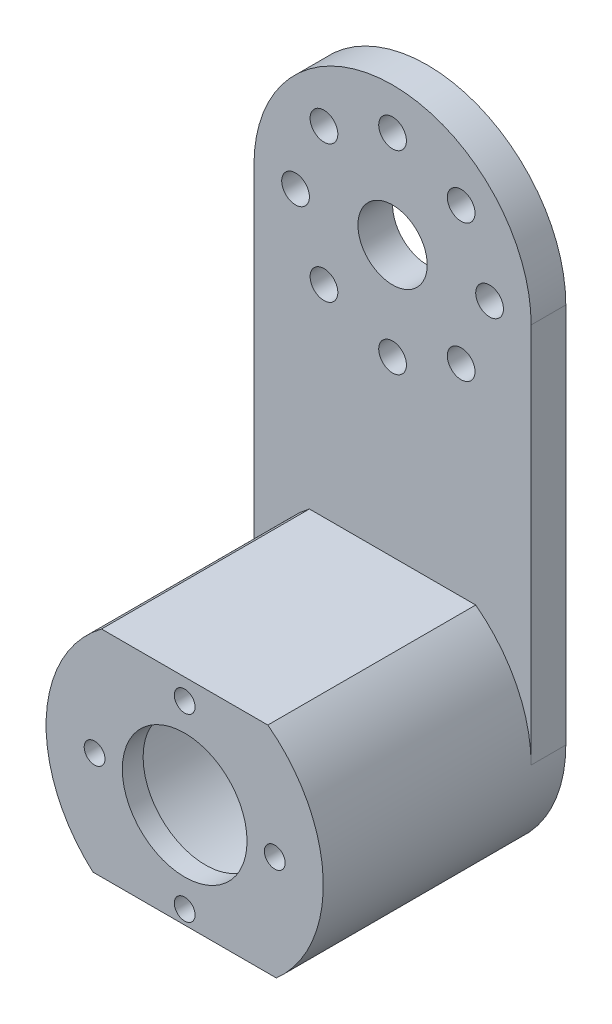
ISO-10303-21;
HEADER;
FILE_DESCRIPTION(('STEP AP214'),'2;1');
FILE_NAME('part.step','',(''),(''),'','','');
FILE_SCHEMA(('AUTOMOTIVE_DESIGN { 1 0 10303 214 1 1 1 1 }'));
ENDSEC;
DATA;
#1=APPLICATION_CONTEXT('core data for automotive mechanical design processes');
#2=APPLICATION_PROTOCOL_DEFINITION('international standard','automotive_design',2000,#1);
#3=PRODUCT_CONTEXT('',#1,'mechanical');
#4=PRODUCT('Part','Part','',(#3));
#5=PRODUCT_RELATED_PRODUCT_CATEGORY('part','',(#4));
#6=PRODUCT_DEFINITION_FORMATION('','',#4);
#7=PRODUCT_DEFINITION_CONTEXT('part definition',#1,'design');
#8=PRODUCT_DEFINITION('design','',#6,#7);
#9=PRODUCT_DEFINITION_SHAPE('','',#8);
#10=(LENGTH_UNIT() NAMED_UNIT(*) SI_UNIT(.MILLI.,.METRE.));
#11=(NAMED_UNIT(*) PLANE_ANGLE_UNIT() SI_UNIT($,.RADIAN.));
#12=(NAMED_UNIT(*) SI_UNIT($,.STERADIAN.) SOLID_ANGLE_UNIT());
#13=UNCERTAINTY_MEASURE_WITH_UNIT(LENGTH_MEASURE(1.E-05),#10,'distance_accuracy_value','');
#14=(GEOMETRIC_REPRESENTATION_CONTEXT(3) GLOBAL_UNCERTAINTY_ASSIGNED_CONTEXT((#13)) GLOBAL_UNIT_ASSIGNED_CONTEXT((#10,
#11,#12)) REPRESENTATION_CONTEXT('',''));
#15=CARTESIAN_POINT('',(0.,0.,0.));
#16=DIRECTION('',(0.,0.,1.));
#17=DIRECTION('',(1.,0.,0.));
#18=AXIS2_PLACEMENT_3D('',#15,#16,#17);
#19=CARTESIAN_POINT('',(0.,-75.,35.));
#20=DIRECTION('',(0.,0.,-1.));
#21=DIRECTION('',(-1.,0.,0.));
#22=AXIS2_PLACEMENT_3D('',#19,#20,#21);
#23=CYLINDRICAL_SURFACE('',#22,8.99999999999999);
#24=CARTESIAN_POINT('',(0.,-75.,35.));
#25=DIRECTION('',(0.,0.,1.));
#26=DIRECTION('',(1.,0.,0.));
#27=AXIS2_PLACEMENT_3D('',#24,#25,#26);
#28=CIRCLE('',#27,8.99999999999999);
#29=CARTESIAN_POINT('',(8.99999999999999,-75.,35.));
#30=VERTEX_POINT('',#29);
#31=EDGE_CURVE('E108',#30,#30,#28,.T.);
#32=ORIENTED_EDGE('',*,*,#31,.T.);
#33=EDGE_LOOP('',(#32));
#34=FACE_BOUND('',#33,.T.);
#35=CARTESIAN_POINT('',(0.,-75.,32.));
#36=DIRECTION('',(0.,0.,-1.));
#37=DIRECTION('',(-1.,0.,0.));
#38=AXIS2_PLACEMENT_3D('',#35,#36,#37);
#39=CIRCLE('',#38,8.99999999999999);
#40=CARTESIAN_POINT('',(-8.99999999999999,-75.,32.));
#41=VERTEX_POINT('',#40);
#42=EDGE_CURVE('E167',#41,#41,#39,.T.);
#43=ORIENTED_EDGE('',*,*,#42,.T.);
#44=EDGE_LOOP('',(#43));
#45=FACE_BOUND('',#44,.T.);
#46=ADVANCED_FACE('F31',(#34,#45),#23,.F.);
#47=CARTESIAN_POINT('',(0.,-62.,35.));
#48=DIRECTION('',(0.,0.,-1.));
#49=DIRECTION('',(-1.,0.,0.));
#50=AXIS2_PLACEMENT_3D('',#47,#48,#49);
#51=CYLINDRICAL_SURFACE('',#50,1.5);
#52=CARTESIAN_POINT('',(0.,-62.,35.));
#53=DIRECTION('',(0.,0.,1.));
#54=DIRECTION('',(1.,0.,0.));
#55=AXIS2_PLACEMENT_3D('',#52,#53,#54);
#56=CIRCLE('',#55,1.5);
#57=CARTESIAN_POINT('',(1.5,-62.,35.));
#58=VERTEX_POINT('',#57);
#59=EDGE_CURVE('E178',#58,#58,#56,.T.);
#60=ORIENTED_EDGE('',*,*,#59,.T.);
#61=EDGE_LOOP('',(#60));
#62=FACE_BOUND('',#61,.T.);
#63=CARTESIAN_POINT('',(0.,-62.,32.));
#64=DIRECTION('',(0.,0.,-1.));
#65=DIRECTION('',(-1.,0.,0.));
#66=AXIS2_PLACEMENT_3D('',#63,#64,#65);
#67=CIRCLE('',#66,1.5);
#68=CARTESIAN_POINT('',(-1.5,-62.,32.));
#69=VERTEX_POINT('',#68);
#70=EDGE_CURVE('E164',#69,#69,#67,.T.);
#71=ORIENTED_EDGE('',*,*,#70,.T.);
#72=EDGE_LOOP('',(#71));
#73=FACE_BOUND('',#72,.T.);
#74=ADVANCED_FACE('F212',(#62,#73),#51,.F.);
#75=CARTESIAN_POINT('',(0.,-88.,35.));
#76=DIRECTION('',(0.,0.,-1.));
#77=DIRECTION('',(-1.,0.,0.));
#78=AXIS2_PLACEMENT_3D('',#75,#76,#77);
#79=CYLINDRICAL_SURFACE('',#78,1.5);
#80=CARTESIAN_POINT('',(0.,-88.,35.));
#81=DIRECTION('',(0.,0.,1.));
#82=DIRECTION('',(1.,0.,0.));
#83=AXIS2_PLACEMENT_3D('',#80,#81,#82);
#84=CIRCLE('',#83,1.5);
#85=CARTESIAN_POINT('',(1.5,-88.,35.));
#86=VERTEX_POINT('',#85);
#87=EDGE_CURVE('E176',#86,#86,#84,.T.);
#88=ORIENTED_EDGE('',*,*,#87,.T.);
#89=EDGE_LOOP('',(#88));
#90=FACE_BOUND('',#89,.T.);
#91=CARTESIAN_POINT('',(0.,-88.,32.));
#92=DIRECTION('',(0.,0.,-1.));
#93=DIRECTION('',(-1.,0.,0.));
#94=AXIS2_PLACEMENT_3D('',#91,#92,#93);
#95=CIRCLE('',#94,1.5);
#96=CARTESIAN_POINT('',(-1.5,-88.,32.));
#97=VERTEX_POINT('',#96);
#98=EDGE_CURVE('E155',#97,#97,#95,.T.);
#99=ORIENTED_EDGE('',*,*,#98,.T.);
#100=EDGE_LOOP('',(#99));
#101=FACE_BOUND('',#100,.T.);
#102=ADVANCED_FACE('F207',(#90,#101),#79,.F.);
#103=CARTESIAN_POINT('',(-13.,-75.,35.));
#104=DIRECTION('',(0.,0.,-1.));
#105=DIRECTION('',(-1.,0.,0.));
#106=AXIS2_PLACEMENT_3D('',#103,#104,#105);
#107=CYLINDRICAL_SURFACE('',#106,1.5);
#108=CARTESIAN_POINT('',(-13.,-75.,35.));
#109=DIRECTION('',(0.,0.,1.));
#110=DIRECTION('',(1.,0.,0.));
#111=AXIS2_PLACEMENT_3D('',#108,#109,#110);
#112=CIRCLE('',#111,1.5);
#113=CARTESIAN_POINT('',(-11.5,-75.,35.));
#114=VERTEX_POINT('',#113);
#115=EDGE_CURVE('E173',#114,#114,#112,.T.);
#116=ORIENTED_EDGE('',*,*,#115,.T.);
#117=EDGE_LOOP('',(#116));
#118=FACE_BOUND('',#117,.T.);
#119=CARTESIAN_POINT('',(-13.,-75.,32.));
#120=DIRECTION('',(0.,0.,-1.));
#121=DIRECTION('',(-1.,0.,0.));
#122=AXIS2_PLACEMENT_3D('',#119,#120,#121);
#123=CIRCLE('',#122,1.5);
#124=CARTESIAN_POINT('',(-14.5,-75.,32.));
#125=VERTEX_POINT('',#124);
#126=EDGE_CURVE('E151',#125,#125,#123,.T.);
#127=ORIENTED_EDGE('',*,*,#126,.T.);
#128=EDGE_LOOP('',(#127));
#129=FACE_BOUND('',#128,.T.);
#130=ADVANCED_FACE('F199',(#118,#129),#107,.F.);
#131=CARTESIAN_POINT('',(13.,-75.,35.));
#132=DIRECTION('',(0.,0.,-1.));
#133=DIRECTION('',(-1.,0.,0.));
#134=AXIS2_PLACEMENT_3D('',#131,#132,#133);
#135=CYLINDRICAL_SURFACE('',#134,1.5);
#136=CARTESIAN_POINT('',(13.,-75.,35.));
#137=DIRECTION('',(0.,0.,1.));
#138=DIRECTION('',(1.,0.,0.));
#139=AXIS2_PLACEMENT_3D('',#136,#137,#138);
#140=CIRCLE('',#139,1.5);
#141=CARTESIAN_POINT('',(14.5,-75.,35.));
#142=VERTEX_POINT('',#141);
#143=EDGE_CURVE('E170',#142,#142,#140,.T.);
#144=ORIENTED_EDGE('',*,*,#143,.T.);
#145=EDGE_LOOP('',(#144));
#146=FACE_BOUND('',#145,.T.);
#147=CARTESIAN_POINT('',(13.,-75.,32.));
#148=DIRECTION('',(0.,0.,-1.));
#149=DIRECTION('',(-1.,0.,0.));
#150=AXIS2_PLACEMENT_3D('',#147,#148,#149);
#151=CIRCLE('',#150,1.5);
#152=CARTESIAN_POINT('',(11.5,-75.,32.));
#153=VERTEX_POINT('',#152);
#154=EDGE_CURVE('E149',#153,#153,#151,.T.);
#155=ORIENTED_EDGE('',*,*,#154,.T.);
#156=EDGE_LOOP('',(#155));
#157=FACE_BOUND('',#156,.T.);
#158=ADVANCED_FACE('F196',(#146,#157),#135,.F.);
#159=CARTESIAN_POINT('',(0.,-20.,5.));
#160=DIRECTION('',(0.,0.,1.));
#161=DIRECTION('',(1.,0.,0.));
#162=AXIS2_PLACEMENT_3D('',#159,#160,#161);
#163=PLANE('',#162);
#164=CARTESIAN_POINT('',(0.,-75.,5.));
#165=DIRECTION('',(0.,0.,1.));
#166=DIRECTION('',(1.,0.,0.));
#167=AXIS2_PLACEMENT_3D('',#164,#165,#166);
#168=CIRCLE('',#167,20.);
#169=CARTESIAN_POINT('',(-12.,-59.,5.));
#170=VERTEX_POINT('',#169);
#171=CARTESIAN_POINT('',(-20.,-75.,5.));
#172=VERTEX_POINT('',#171);
#173=EDGE_CURVE('E112',#170,#172,#168,.T.);
#174=ORIENTED_EDGE('',*,*,#173,.F.);
#175=DIRECTION('',(-1.,0.,0.));
#176=VECTOR('',#175,1.);
#177=CARTESIAN_POINT('',(12.,-59.,5.));
#178=LINE('',#177,#176);
#179=CARTESIAN_POINT('',(12.,-59.,5.));
#180=VERTEX_POINT('',#179);
#181=EDGE_CURVE('E52',#180,#170,#178,.T.);
#182=ORIENTED_EDGE('',*,*,#181,.F.);
#183=CARTESIAN_POINT('',(20.,-75.,5.));
#184=VERTEX_POINT('',#183);
#185=EDGE_CURVE('E39',#184,#180,#168,.T.);
#186=ORIENTED_EDGE('',*,*,#185,.F.);
#187=DIRECTION('',(0.,1.,0.));
#188=VECTOR('',#187,1.);
#189=CARTESIAN_POINT('',(20.,-20.,5.));
#190=LINE('',#189,#188);
#191=CARTESIAN_POINT('',(20.,-20.,5.));
#192=VERTEX_POINT('',#191);
#193=EDGE_CURVE('E137',#184,#192,#190,.T.);
#194=ORIENTED_EDGE('',*,*,#193,.T.);
#195=CARTESIAN_POINT('',(0.,-20.,5.));
#196=DIRECTION('',(0.,0.,1.));
#197=DIRECTION('',(1.,0.,0.));
#198=AXIS2_PLACEMENT_3D('',#195,#196,#197);
#199=CIRCLE('',#198,20.);
#200=CARTESIAN_POINT('',(-20.,-20.,5.));
#201=VERTEX_POINT('',#200);
#202=EDGE_CURVE('E143',#192,#201,#199,.T.);
#203=ORIENTED_EDGE('',*,*,#202,.T.);
#204=DIRECTION('',(0.,-1.,0.));
#205=VECTOR('',#204,1.);
#206=CARTESIAN_POINT('',(-20.,-20.,5.));
#207=LINE('',#206,#205);
#208=EDGE_CURVE('E139',#201,#172,#207,.T.);
#209=ORIENTED_EDGE('',*,*,#208,.T.);
#210=EDGE_LOOP('',(#174,#182,#186,#194,#203,#209));
#211=FACE_BOUND('',#210,.T.);
#212=CARTESIAN_POINT('',(-1.42247325030098E-13,-34.,5.));
#213=DIRECTION('',(0.,0.,1.));
#214=DIRECTION('',(1.,0.,0.));
#215=AXIS2_PLACEMENT_3D('',#212,#213,#214);
#216=CIRCLE('',#215,2.);
#217=CARTESIAN_POINT('',(1.99999999999985,-34.,5.));
#218=VERTEX_POINT('',#217);
#219=EDGE_CURVE('E346',#218,#218,#216,.T.);
#220=ORIENTED_EDGE('',*,*,#219,.F.);
#221=EDGE_LOOP('',(#220));
#222=FACE_BOUND('',#221,.T.);
#223=CARTESIAN_POINT('',(14.,-20.0000000000001,5.));
#224=DIRECTION('',(0.,0.,1.));
#225=DIRECTION('',(1.,0.,0.));
#226=AXIS2_PLACEMENT_3D('',#223,#224,#225);
#227=CIRCLE('',#226,2.);
#228=CARTESIAN_POINT('',(16.,-20.0000000000001,5.));
#229=VERTEX_POINT('',#228);
#230=EDGE_CURVE('E334',#229,#229,#227,.T.);
#231=ORIENTED_EDGE('',*,*,#230,.F.);
#232=EDGE_LOOP('',(#231));
#233=FACE_BOUND('',#232,.T.);
#234=CARTESIAN_POINT('',(0.,-6.,5.));
#235=DIRECTION('',(0.,0.,1.));
#236=DIRECTION('',(1.,0.,0.));
#237=AXIS2_PLACEMENT_3D('',#234,#235,#236);
#238=CIRCLE('',#237,2.);
#239=CARTESIAN_POINT('',(2.00000000000005,-6.,5.));
#240=VERTEX_POINT('',#239);
#241=EDGE_CURVE('E322',#240,#240,#238,.T.);
#242=ORIENTED_EDGE('',*,*,#241,.F.);
#243=EDGE_LOOP('',(#242));
#244=FACE_BOUND('',#243,.T.);
#245=CARTESIAN_POINT('',(-14.,-20.,5.));
#246=DIRECTION('',(0.,0.,1.));
#247=DIRECTION('',(1.,0.,0.));
#248=AXIS2_PLACEMENT_3D('',#245,#246,#247);
#249=CIRCLE('',#248,2.);
#250=CARTESIAN_POINT('',(-12.,-20.,5.));
#251=VERTEX_POINT('',#250);
#252=EDGE_CURVE('E310',#251,#251,#249,.T.);
#253=ORIENTED_EDGE('',*,*,#252,.F.);
#254=EDGE_LOOP('',(#253));
#255=FACE_BOUND('',#254,.T.);
#256=CARTESIAN_POINT('',(0.,-20.,5.));
#257=DIRECTION('',(0.,0.,1.));
#258=DIRECTION('',(1.,0.,0.));
#259=AXIS2_PLACEMENT_3D('',#256,#257,#258);
#260=CIRCLE('',#259,5.);
#261=CARTESIAN_POINT('',(5.,-20.,5.));
#262=VERTEX_POINT('',#261);
#263=EDGE_CURVE('E303',#262,#262,#260,.T.);
#264=ORIENTED_EDGE('',*,*,#263,.F.);
#265=EDGE_LOOP('',(#264));
#266=FACE_BOUND('',#265,.T.);
#267=CARTESIAN_POINT('',(-9.89949493661165,-10.1005050633883,5.));
#268=DIRECTION('',(0.,0.,1.));
#269=DIRECTION('',(1.,0.,0.));
#270=AXIS2_PLACEMENT_3D('',#267,#268,#269);
#271=CIRCLE('',#270,2.);
#272=CARTESIAN_POINT('',(-7.89949493661165,-10.1005050633883,5.));
#273=VERTEX_POINT('',#272);
#274=EDGE_CURVE('E316',#273,#273,#271,.T.);
#275=ORIENTED_EDGE('',*,*,#274,.F.);
#276=EDGE_LOOP('',(#275));
#277=FACE_BOUND('',#276,.T.);
#278=CARTESIAN_POINT('',(9.89949493661171,-10.1005050633884,5.));
#279=DIRECTION('',(0.,0.,1.));
#280=DIRECTION('',(1.,0.,0.));
#281=AXIS2_PLACEMENT_3D('',#278,#279,#280);
#282=CIRCLE('',#281,2.);
#283=CARTESIAN_POINT('',(11.8994949366117,-10.1005050633884,5.));
#284=VERTEX_POINT('',#283);
#285=EDGE_CURVE('E328',#284,#284,#282,.T.);
#286=ORIENTED_EDGE('',*,*,#285,.F.);
#287=EDGE_LOOP('',(#286));
#288=FACE_BOUND('',#287,.T.);
#289=CARTESIAN_POINT('',(9.89949493661159,-29.8994949366118,5.));
#290=DIRECTION('',(0.,0.,1.));
#291=DIRECTION('',(1.,0.,0.));
#292=AXIS2_PLACEMENT_3D('',#289,#290,#291);
#293=CIRCLE('',#292,2.);
#294=CARTESIAN_POINT('',(11.8994949366116,-29.8994949366118,5.));
#295=VERTEX_POINT('',#294);
#296=EDGE_CURVE('E340',#295,#295,#293,.T.);
#297=ORIENTED_EDGE('',*,*,#296,.F.);
#298=EDGE_LOOP('',(#297));
#299=FACE_BOUND('',#298,.T.);
#300=CARTESIAN_POINT('',(-9.89949493661179,-29.8994949366115,5.));
#301=DIRECTION('',(0.,0.,1.));
#302=DIRECTION('',(1.,0.,0.));
#303=AXIS2_PLACEMENT_3D('',#300,#301,#302);
#304=CIRCLE('',#303,2.);
#305=CARTESIAN_POINT('',(-7.89949493661178,-29.8994949366115,5.));
#306=VERTEX_POINT('',#305);
#307=EDGE_CURVE('E121',#306,#306,#304,.T.);
#308=ORIENTED_EDGE('',*,*,#307,.F.);
#309=EDGE_LOOP('',(#308));
#310=FACE_BOUND('',#309,.T.);
#311=ADVANCED_FACE('F198',(#211,#222,#233,#244,#255,#266,#277,#288,#299,#310),#163,.T.);
#312=CARTESIAN_POINT('',(0.,-20.,0.));
#313=DIRECTION('',(0.,0.,1.));
#314=DIRECTION('',(1.,0.,0.));
#315=AXIS2_PLACEMENT_3D('',#312,#313,#314);
#316=PLANE('',#315);
#317=CARTESIAN_POINT('',(-1.42247325030098E-13,-34.,0.));
#318=DIRECTION('',(0.,0.,1.));
#319=DIRECTION('',(1.,0.,0.));
#320=AXIS2_PLACEMENT_3D('',#317,#318,#319);
#321=CIRCLE('',#320,2.);
#322=CARTESIAN_POINT('',(1.99999999999985,-34.,0.));
#323=VERTEX_POINT('',#322);
#324=EDGE_CURVE('E349',#323,#323,#321,.T.);
#325=ORIENTED_EDGE('',*,*,#324,.T.);
#326=EDGE_LOOP('',(#325));
#327=FACE_BOUND('',#326,.T.);
#328=CARTESIAN_POINT('',(14.,-20.0000000000001,0.));
#329=DIRECTION('',(0.,0.,1.));
#330=DIRECTION('',(1.,0.,0.));
#331=AXIS2_PLACEMENT_3D('',#328,#329,#330);
#332=CIRCLE('',#331,2.);
#333=CARTESIAN_POINT('',(16.,-20.0000000000001,0.));
#334=VERTEX_POINT('',#333);
#335=EDGE_CURVE('E337',#334,#334,#332,.T.);
#336=ORIENTED_EDGE('',*,*,#335,.T.);
#337=EDGE_LOOP('',(#336));
#338=FACE_BOUND('',#337,.T.);
#339=CARTESIAN_POINT('',(0.,-6.,0.));
#340=DIRECTION('',(0.,0.,1.));
#341=DIRECTION('',(1.,0.,0.));
#342=AXIS2_PLACEMENT_3D('',#339,#340,#341);
#343=CIRCLE('',#342,2.);
#344=CARTESIAN_POINT('',(2.00000000000005,-6.,0.));
#345=VERTEX_POINT('',#344);
#346=EDGE_CURVE('E325',#345,#345,#343,.T.);
#347=ORIENTED_EDGE('',*,*,#346,.T.);
#348=EDGE_LOOP('',(#347));
#349=FACE_BOUND('',#348,.T.);
#350=CARTESIAN_POINT('',(-14.,-20.,0.));
#351=DIRECTION('',(0.,0.,1.));
#352=DIRECTION('',(1.,0.,0.));
#353=AXIS2_PLACEMENT_3D('',#350,#351,#352);
#354=CIRCLE('',#353,2.);
#355=CARTESIAN_POINT('',(-12.,-20.,0.));
#356=VERTEX_POINT('',#355);
#357=EDGE_CURVE('E313',#356,#356,#354,.T.);
#358=ORIENTED_EDGE('',*,*,#357,.T.);
#359=EDGE_LOOP('',(#358));
#360=FACE_BOUND('',#359,.T.);
#361=CARTESIAN_POINT('',(0.,-75.,0.));
#362=DIRECTION('',(0.,0.,1.));
#363=DIRECTION('',(1.,0.,0.));
#364=AXIS2_PLACEMENT_3D('',#361,#362,#363);
#365=CIRCLE('',#364,15.);
#366=CARTESIAN_POINT('',(15.,-75.,0.));
#367=VERTEX_POINT('',#366);
#368=EDGE_CURVE('E301',#367,#367,#365,.T.);
#369=ORIENTED_EDGE('',*,*,#368,.T.);
#370=EDGE_LOOP('',(#369));
#371=FACE_BOUND('',#370,.T.);
#372=CARTESIAN_POINT('',(0.,-20.,0.));
#373=DIRECTION('',(0.,0.,1.));
#374=DIRECTION('',(1.,0.,0.));
#375=AXIS2_PLACEMENT_3D('',#372,#373,#374);
#376=CIRCLE('',#375,20.);
#377=CARTESIAN_POINT('',(20.,-20.,0.));
#378=VERTEX_POINT('',#377);
#379=CARTESIAN_POINT('',(-20.,-20.,0.));
#380=VERTEX_POINT('',#379);
#381=EDGE_CURVE('E287',#378,#380,#376,.T.);
#382=ORIENTED_EDGE('',*,*,#381,.F.);
#383=DIRECTION('',(0.,1.,0.));
#384=VECTOR('',#383,1.);
#385=CARTESIAN_POINT('',(20.,-20.,0.));
#386=LINE('',#385,#384);
#387=CARTESIAN_POINT('',(20.,-75.,0.));
#388=VERTEX_POINT('',#387);
#389=EDGE_CURVE('E292',#388,#378,#386,.T.);
#390=ORIENTED_EDGE('',*,*,#389,.F.);
#391=CARTESIAN_POINT('',(0.,-75.,0.));
#392=DIRECTION('',(0.,0.,1.));
#393=DIRECTION('',(1.,0.,0.));
#394=AXIS2_PLACEMENT_3D('',#391,#392,#393);
#395=CIRCLE('',#394,20.);
#396=CARTESIAN_POINT('',(-20.,-75.,0.));
#397=VERTEX_POINT('',#396);
#398=EDGE_CURVE('E286',#397,#388,#395,.T.);
#399=ORIENTED_EDGE('',*,*,#398,.F.);
#400=DIRECTION('',(0.,-1.,0.));
#401=VECTOR('',#400,1.);
#402=CARTESIAN_POINT('',(-20.,-20.,0.));
#403=LINE('',#402,#401);
#404=EDGE_CURVE('E280',#380,#397,#403,.T.);
#405=ORIENTED_EDGE('',*,*,#404,.F.);
#406=EDGE_LOOP('',(#382,#390,#399,#405));
#407=FACE_BOUND('',#406,.T.);
#408=CARTESIAN_POINT('',(0.,-20.,0.));
#409=DIRECTION('',(0.,0.,1.));
#410=DIRECTION('',(1.,0.,0.));
#411=AXIS2_PLACEMENT_3D('',#408,#409,#410);
#412=CIRCLE('',#411,5.);
#413=CARTESIAN_POINT('',(5.,-20.,0.));
#414=VERTEX_POINT('',#413);
#415=EDGE_CURVE('E307',#414,#414,#412,.T.);
#416=ORIENTED_EDGE('',*,*,#415,.T.);
#417=EDGE_LOOP('',(#416));
#418=FACE_BOUND('',#417,.T.);
#419=CARTESIAN_POINT('',(-9.89949493661165,-10.1005050633883,0.));
#420=DIRECTION('',(0.,0.,1.));
#421=DIRECTION('',(1.,0.,0.));
#422=AXIS2_PLACEMENT_3D('',#419,#420,#421);
#423=CIRCLE('',#422,2.);
#424=CARTESIAN_POINT('',(-7.89949493661165,-10.1005050633883,0.));
#425=VERTEX_POINT('',#424);
#426=EDGE_CURVE('E319',#425,#425,#423,.T.);
#427=ORIENTED_EDGE('',*,*,#426,.T.);
#428=EDGE_LOOP('',(#427));
#429=FACE_BOUND('',#428,.T.);
#430=CARTESIAN_POINT('',(9.89949493661171,-10.1005050633884,0.));
#431=DIRECTION('',(0.,0.,1.));
#432=DIRECTION('',(1.,0.,0.));
#433=AXIS2_PLACEMENT_3D('',#430,#431,#432);
#434=CIRCLE('',#433,2.);
#435=CARTESIAN_POINT('',(11.8994949366117,-10.1005050633884,0.));
#436=VERTEX_POINT('',#435);
#437=EDGE_CURVE('E331',#436,#436,#434,.T.);
#438=ORIENTED_EDGE('',*,*,#437,.T.);
#439=EDGE_LOOP('',(#438));
#440=FACE_BOUND('',#439,.T.);
#441=CARTESIAN_POINT('',(9.89949493661159,-29.8994949366118,0.));
#442=DIRECTION('',(0.,0.,1.));
#443=DIRECTION('',(1.,0.,0.));
#444=AXIS2_PLACEMENT_3D('',#441,#442,#443);
#445=CIRCLE('',#444,2.);
#446=CARTESIAN_POINT('',(11.8994949366116,-29.8994949366118,0.));
#447=VERTEX_POINT('',#446);
#448=EDGE_CURVE('E343',#447,#447,#445,.T.);
#449=ORIENTED_EDGE('',*,*,#448,.T.);
#450=EDGE_LOOP('',(#449));
#451=FACE_BOUND('',#450,.T.);
#452=CARTESIAN_POINT('',(-9.89949493661179,-29.8994949366115,0.));
#453=DIRECTION('',(0.,0.,1.));
#454=DIRECTION('',(1.,0.,0.));
#455=AXIS2_PLACEMENT_3D('',#452,#453,#454);
#456=CIRCLE('',#455,2.);
#457=CARTESIAN_POINT('',(-7.89949493661178,-29.8994949366115,0.));
#458=VERTEX_POINT('',#457);
#459=EDGE_CURVE('E117',#458,#458,#456,.T.);
#460=ORIENTED_EDGE('',*,*,#459,.T.);
#461=EDGE_LOOP('',(#460));
#462=FACE_BOUND('',#461,.T.);
#463=ADVANCED_FACE('F205',(#327,#338,#349,#360,#371,#407,#418,#429,#440,#451,#462),#316,.F.);
#464=CARTESIAN_POINT('',(0.,-20.,5.));
#465=DIRECTION('',(0.,0.,-1.));
#466=DIRECTION('',(-1.,0.,0.));
#467=AXIS2_PLACEMENT_3D('',#464,#465,#466);
#468=CYLINDRICAL_SURFACE('',#467,20.);
#469=ORIENTED_EDGE('',*,*,#381,.T.);
#470=DIRECTION('',(0.,0.,-1.));
#471=VECTOR('',#470,1.);
#472=CARTESIAN_POINT('',(-20.,-20.,5.));
#473=LINE('',#472,#471);
#474=EDGE_CURVE('E126',#201,#380,#473,.T.);
#475=ORIENTED_EDGE('',*,*,#474,.F.);
#476=ORIENTED_EDGE('',*,*,#202,.F.);
#477=DIRECTION('',(0.,0.,-1.));
#478=VECTOR('',#477,1.);
#479=CARTESIAN_POINT('',(20.,-20.,5.));
#480=LINE('',#479,#478);
#481=EDGE_CURVE('E134',#192,#378,#480,.T.);
#482=ORIENTED_EDGE('',*,*,#481,.T.);
#483=EDGE_LOOP('',(#469,#475,#476,#482));
#484=FACE_BOUND('',#483,.T.);
#485=ADVANCED_FACE('F33',(#484),#468,.T.);
#486=CARTESIAN_POINT('',(-20.,-20.,5.));
#487=DIRECTION('',(1.,0.,0.));
#488=DIRECTION('',(0.,1.,0.));
#489=AXIS2_PLACEMENT_3D('',#486,#487,#488);
#490=PLANE('',#489);
#491=ORIENTED_EDGE('',*,*,#404,.T.);
#492=DIRECTION('',(0.,0.,-1.));
#493=VECTOR('',#492,1.);
#494=CARTESIAN_POINT('',(-20.,-75.,5.));
#495=LINE('',#494,#493);
#496=EDGE_CURVE('E133',#172,#397,#495,.T.);
#497=ORIENTED_EDGE('',*,*,#496,.F.);
#498=ORIENTED_EDGE('',*,*,#208,.F.);
#499=ORIENTED_EDGE('',*,*,#474,.T.);
#500=EDGE_LOOP('',(#491,#497,#498,#499));
#501=FACE_BOUND('',#500,.T.);
#502=ADVANCED_FACE('F271',(#501),#490,.F.);
#503=CARTESIAN_POINT('',(0.,-75.,5.));
#504=DIRECTION('',(0.,0.,-1.));
#505=DIRECTION('',(-1.,0.,0.));
#506=AXIS2_PLACEMENT_3D('',#503,#504,#505);
#507=CYLINDRICAL_SURFACE('',#506,20.);
#508=CARTESIAN_POINT('',(0.,-75.,50.));
#509=DIRECTION('',(0.,0.707106781186547,-0.707106781186548));
#510=DIRECTION('',(0.,-0.707106781186548,-0.707106781186547));
#511=AXIS2_PLACEMENT_3D('',#508,#509,#510);
#512=ELLIPSE('',#511,28.2842712474619,20.);
#513=CARTESIAN_POINT('',(13.228756555323,-90.,35.));
#514=VERTEX_POINT('',#513);
#515=CARTESIAN_POINT('',(-13.228756555323,-90.,35.));
#516=VERTEX_POINT('',#515);
#517=EDGE_CURVE('E44',#514,#516,#512,.T.);
#518=ORIENTED_EDGE('',*,*,#517,.T.);
#519=CARTESIAN_POINT('',(0.,-75.,35.));
#520=DIRECTION('',(0.,0.,1.));
#521=DIRECTION('',(1.,0.,0.));
#522=AXIS2_PLACEMENT_3D('',#519,#520,#521);
#523=CIRCLE('',#522,20.);
#524=CARTESIAN_POINT('',(-12.,-59.,35.));
#525=VERTEX_POINT('',#524);
#526=EDGE_CURVE('E92',#525,#516,#523,.T.);
#527=ORIENTED_EDGE('',*,*,#526,.F.);
#528=DIRECTION('',(0.,0.,-1.));
#529=VECTOR('',#528,1.);
#530=CARTESIAN_POINT('',(-12.,-59.,35.));
#531=LINE('',#530,#529);
#532=EDGE_CURVE('E105',#525,#170,#531,.T.);
#533=ORIENTED_EDGE('',*,*,#532,.T.);
#534=ORIENTED_EDGE('',*,*,#173,.T.);
#535=ORIENTED_EDGE('',*,*,#496,.T.);
#536=ORIENTED_EDGE('',*,*,#398,.T.);
#537=DIRECTION('',(0.,0.,-1.));
#538=VECTOR('',#537,1.);
#539=CARTESIAN_POINT('',(20.,-75.,5.));
#540=LINE('',#539,#538);
#541=EDGE_CURVE('E130',#184,#388,#540,.T.);
#542=ORIENTED_EDGE('',*,*,#541,.F.);
#543=ORIENTED_EDGE('',*,*,#185,.T.);
#544=DIRECTION('',(0.,0.,-1.));
#545=VECTOR('',#544,1.);
#546=CARTESIAN_POINT('',(12.,-59.,35.));
#547=LINE('',#546,#545);
#548=CARTESIAN_POINT('',(12.,-59.,35.));
#549=VERTEX_POINT('',#548);
#550=EDGE_CURVE('E114',#549,#180,#547,.T.);
#551=ORIENTED_EDGE('',*,*,#550,.F.);
#552=EDGE_CURVE('E94',#514,#549,#523,.T.);
#553=ORIENTED_EDGE('',*,*,#552,.F.);
#554=EDGE_LOOP('',(#518,#527,#533,#534,#535,#536,#542,#543,#551,#553));
#555=FACE_BOUND('',#554,.T.);
#556=ADVANCED_FACE('F89',(#555),#507,.T.);
#557=CARTESIAN_POINT('',(20.,-20.,5.));
#558=DIRECTION('',(-1.,0.,0.));
#559=DIRECTION('',(0.,-1.,0.));
#560=AXIS2_PLACEMENT_3D('',#557,#558,#559);
#561=PLANE('',#560);
#562=ORIENTED_EDGE('',*,*,#389,.T.);
#563=ORIENTED_EDGE('',*,*,#481,.F.);
#564=ORIENTED_EDGE('',*,*,#193,.F.);
#565=ORIENTED_EDGE('',*,*,#541,.T.);
#566=EDGE_LOOP('',(#562,#563,#564,#565));
#567=FACE_BOUND('',#566,.T.);
#568=ADVANCED_FACE('F261',(#567),#561,.F.);
#569=CARTESIAN_POINT('',(0.,-75.,5.));
#570=DIRECTION('',(0.,0.,-1.));
#571=DIRECTION('',(-1.,0.,0.));
#572=AXIS2_PLACEMENT_3D('',#569,#570,#571);
#573=CYLINDRICAL_SURFACE('',#572,15.);
#574=ORIENTED_EDGE('',*,*,#368,.F.);
#575=EDGE_LOOP('',(#574));
#576=FACE_BOUND('',#575,.T.);
#577=CARTESIAN_POINT('',(0.,-75.,32.));
#578=DIRECTION('',(0.,0.,-1.));
#579=DIRECTION('',(-1.,0.,0.));
#580=AXIS2_PLACEMENT_3D('',#577,#578,#579);
#581=CIRCLE('',#580,15.);
#582=CARTESIAN_POINT('',(-15.,-75.,32.));
#583=VERTEX_POINT('',#582);
#584=EDGE_CURVE('E95',#583,#583,#581,.T.);
#585=ORIENTED_EDGE('',*,*,#584,.F.);
#586=EDGE_LOOP('',(#585));
#587=FACE_BOUND('',#586,.T.);
#588=ADVANCED_FACE('F258',(#576,#587),#573,.F.);
#589=CARTESIAN_POINT('',(0.,-20.,5.));
#590=DIRECTION('',(0.,0.,-1.));
#591=DIRECTION('',(-1.,0.,0.));
#592=AXIS2_PLACEMENT_3D('',#589,#590,#591);
#593=CYLINDRICAL_SURFACE('',#592,5.);
#594=ORIENTED_EDGE('',*,*,#263,.T.);
#595=EDGE_LOOP('',(#594));
#596=FACE_BOUND('',#595,.T.);
#597=ORIENTED_EDGE('',*,*,#415,.F.);
#598=EDGE_LOOP('',(#597));
#599=FACE_BOUND('',#598,.T.);
#600=ADVANCED_FACE('F254',(#596,#599),#593,.F.);
#601=CARTESIAN_POINT('',(-14.,-20.,5.));
#602=DIRECTION('',(0.,0.,-1.));
#603=DIRECTION('',(-1.,0.,0.));
#604=AXIS2_PLACEMENT_3D('',#601,#602,#603);
#605=CYLINDRICAL_SURFACE('',#604,2.);
#606=ORIENTED_EDGE('',*,*,#252,.T.);
#607=EDGE_LOOP('',(#606));
#608=FACE_BOUND('',#607,.T.);
#609=ORIENTED_EDGE('',*,*,#357,.F.);
#610=EDGE_LOOP('',(#609));
#611=FACE_BOUND('',#610,.T.);
#612=ADVANCED_FACE('F250',(#608,#611),#605,.F.);
#613=CARTESIAN_POINT('',(-9.89949493661165,-10.1005050633883,5.));
#614=DIRECTION('',(0.,0.,-1.));
#615=DIRECTION('',(-1.,0.,0.));
#616=AXIS2_PLACEMENT_3D('',#613,#614,#615);
#617=CYLINDRICAL_SURFACE('',#616,2.);
#618=ORIENTED_EDGE('',*,*,#274,.T.);
#619=EDGE_LOOP('',(#618));
#620=FACE_BOUND('',#619,.T.);
#621=ORIENTED_EDGE('',*,*,#426,.F.);
#622=EDGE_LOOP('',(#621));
#623=FACE_BOUND('',#622,.T.);
#624=ADVANCED_FACE('F246',(#620,#623),#617,.F.);
#625=CARTESIAN_POINT('',(0.,-6.,5.));
#626=DIRECTION('',(0.,0.,-1.));
#627=DIRECTION('',(-1.,0.,0.));
#628=AXIS2_PLACEMENT_3D('',#625,#626,#627);
#629=CYLINDRICAL_SURFACE('',#628,2.);
#630=ORIENTED_EDGE('',*,*,#241,.T.);
#631=EDGE_LOOP('',(#630));
#632=FACE_BOUND('',#631,.T.);
#633=ORIENTED_EDGE('',*,*,#346,.F.);
#634=EDGE_LOOP('',(#633));
#635=FACE_BOUND('',#634,.T.);
#636=ADVANCED_FACE('F242',(#632,#635),#629,.F.);
#637=CARTESIAN_POINT('',(9.89949493661171,-10.1005050633884,5.));
#638=DIRECTION('',(0.,0.,-1.));
#639=DIRECTION('',(-1.,0.,0.));
#640=AXIS2_PLACEMENT_3D('',#637,#638,#639);
#641=CYLINDRICAL_SURFACE('',#640,2.);
#642=ORIENTED_EDGE('',*,*,#285,.T.);
#643=EDGE_LOOP('',(#642));
#644=FACE_BOUND('',#643,.T.);
#645=ORIENTED_EDGE('',*,*,#437,.F.);
#646=EDGE_LOOP('',(#645));
#647=FACE_BOUND('',#646,.T.);
#648=ADVANCED_FACE('F238',(#644,#647),#641,.F.);
#649=CARTESIAN_POINT('',(14.,-20.0000000000001,5.));
#650=DIRECTION('',(0.,0.,-1.));
#651=DIRECTION('',(-1.,0.,0.));
#652=AXIS2_PLACEMENT_3D('',#649,#650,#651);
#653=CYLINDRICAL_SURFACE('',#652,2.);
#654=ORIENTED_EDGE('',*,*,#230,.T.);
#655=EDGE_LOOP('',(#654));
#656=FACE_BOUND('',#655,.T.);
#657=ORIENTED_EDGE('',*,*,#335,.F.);
#658=EDGE_LOOP('',(#657));
#659=FACE_BOUND('',#658,.T.);
#660=ADVANCED_FACE('F234',(#656,#659),#653,.F.);
#661=CARTESIAN_POINT('',(9.89949493661159,-29.8994949366118,5.));
#662=DIRECTION('',(0.,0.,-1.));
#663=DIRECTION('',(-1.,0.,0.));
#664=AXIS2_PLACEMENT_3D('',#661,#662,#663);
#665=CYLINDRICAL_SURFACE('',#664,2.);
#666=ORIENTED_EDGE('',*,*,#296,.T.);
#667=EDGE_LOOP('',(#666));
#668=FACE_BOUND('',#667,.T.);
#669=ORIENTED_EDGE('',*,*,#448,.F.);
#670=EDGE_LOOP('',(#669));
#671=FACE_BOUND('',#670,.T.);
#672=ADVANCED_FACE('F230',(#668,#671),#665,.F.);
#673=CARTESIAN_POINT('',(-1.42247325030098E-13,-34.,5.));
#674=DIRECTION('',(0.,0.,-1.));
#675=DIRECTION('',(-1.,0.,0.));
#676=AXIS2_PLACEMENT_3D('',#673,#674,#675);
#677=CYLINDRICAL_SURFACE('',#676,2.);
#678=ORIENTED_EDGE('',*,*,#219,.T.);
#679=EDGE_LOOP('',(#678));
#680=FACE_BOUND('',#679,.T.);
#681=ORIENTED_EDGE('',*,*,#324,.F.);
#682=EDGE_LOOP('',(#681));
#683=FACE_BOUND('',#682,.T.);
#684=ADVANCED_FACE('F226',(#680,#683),#677,.F.);
#685=CARTESIAN_POINT('',(-9.89949493661179,-29.8994949366115,5.));
#686=DIRECTION('',(0.,0.,-1.));
#687=DIRECTION('',(-1.,0.,0.));
#688=AXIS2_PLACEMENT_3D('',#685,#686,#687);
#689=CYLINDRICAL_SURFACE('',#688,2.);
#690=ORIENTED_EDGE('',*,*,#307,.T.);
#691=EDGE_LOOP('',(#690));
#692=FACE_BOUND('',#691,.T.);
#693=ORIENTED_EDGE('',*,*,#459,.F.);
#694=EDGE_LOOP('',(#693));
#695=FACE_BOUND('',#694,.T.);
#696=ADVANCED_FACE('F190',(#692,#695),#689,.F.);
#697=CARTESIAN_POINT('',(0.,-75.,35.));
#698=DIRECTION('',(0.,0.,1.));
#699=DIRECTION('',(1.,0.,0.));
#700=AXIS2_PLACEMENT_3D('',#697,#698,#699);
#701=PLANE('',#700);
#702=DIRECTION('',(-1.,0.,0.));
#703=VECTOR('',#702,1.);
#704=CARTESIAN_POINT('',(0.,-90.,35.));
#705=LINE('',#704,#703);
#706=EDGE_CURVE('E11',#514,#516,#705,.T.);
#707=ORIENTED_EDGE('',*,*,#706,.F.);
#708=ORIENTED_EDGE('',*,*,#552,.T.);
#709=DIRECTION('',(-1.,0.,0.));
#710=VECTOR('',#709,1.);
#711=CARTESIAN_POINT('',(12.,-59.,35.));
#712=LINE('',#711,#710);
#713=EDGE_CURVE('E102',#549,#525,#712,.T.);
#714=ORIENTED_EDGE('',*,*,#713,.T.);
#715=ORIENTED_EDGE('',*,*,#526,.T.);
#716=EDGE_LOOP('',(#707,#708,#714,#715));
#717=FACE_BOUND('',#716,.T.);
#718=ORIENTED_EDGE('',*,*,#115,.F.);
#719=EDGE_LOOP('',(#718));
#720=FACE_BOUND('',#719,.T.);
#721=ORIENTED_EDGE('',*,*,#59,.F.);
#722=EDGE_LOOP('',(#721));
#723=FACE_BOUND('',#722,.T.);
#724=ORIENTED_EDGE('',*,*,#31,.F.);
#725=EDGE_LOOP('',(#724));
#726=FACE_BOUND('',#725,.T.);
#727=ORIENTED_EDGE('',*,*,#87,.F.);
#728=EDGE_LOOP('',(#727));
#729=FACE_BOUND('',#728,.T.);
#730=ORIENTED_EDGE('',*,*,#143,.F.);
#731=EDGE_LOOP('',(#730));
#732=FACE_BOUND('',#731,.T.);
#733=ADVANCED_FACE('F99',(#717,#720,#723,#726,#729,#732),#701,.T.);
#734=CARTESIAN_POINT('',(12.,-59.,35.));
#735=DIRECTION('',(0.,-1.,0.));
#736=DIRECTION('',(1.,0.,0.));
#737=AXIS2_PLACEMENT_3D('',#734,#735,#736);
#738=PLANE('',#737);
#739=ORIENTED_EDGE('',*,*,#181,.T.);
#740=ORIENTED_EDGE('',*,*,#532,.F.);
#741=ORIENTED_EDGE('',*,*,#713,.F.);
#742=ORIENTED_EDGE('',*,*,#550,.T.);
#743=EDGE_LOOP('',(#739,#740,#741,#742));
#744=FACE_BOUND('',#743,.T.);
#745=ADVANCED_FACE('F189',(#744),#738,.F.);
#746=CARTESIAN_POINT('',(0.,-75.,32.));
#747=DIRECTION('',(0.,0.,-1.));
#748=DIRECTION('',(-1.,0.,0.));
#749=AXIS2_PLACEMENT_3D('',#746,#747,#748);
#750=PLANE('',#749);
#751=ORIENTED_EDGE('',*,*,#42,.F.);
#752=EDGE_LOOP('',(#751));
#753=FACE_BOUND('',#752,.T.);
#754=ORIENTED_EDGE('',*,*,#70,.F.);
#755=EDGE_LOOP('',(#754));
#756=FACE_BOUND('',#755,.T.);
#757=ORIENTED_EDGE('',*,*,#98,.F.);
#758=EDGE_LOOP('',(#757));
#759=FACE_BOUND('',#758,.T.);
#760=ORIENTED_EDGE('',*,*,#126,.F.);
#761=EDGE_LOOP('',(#760));
#762=FACE_BOUND('',#761,.T.);
#763=ORIENTED_EDGE('',*,*,#154,.F.);
#764=EDGE_LOOP('',(#763));
#765=FACE_BOUND('',#764,.T.);
#766=ORIENTED_EDGE('',*,*,#584,.T.);
#767=EDGE_LOOP('',(#766));
#768=FACE_BOUND('',#767,.T.);
#769=ADVANCED_FACE('F222',(#753,#756,#759,#762,#765,#768),#750,.T.);
#770=CARTESIAN_POINT('',(-20.00005,-90.,35.));
#771=DIRECTION('',(0.,0.707106781186547,-0.707106781186548));
#772=DIRECTION('',(0.,0.707106781186548,0.707106781186547));
#773=AXIS2_PLACEMENT_3D('',#770,#771,#772);
#774=PLANE('',#773);
#775=ORIENTED_EDGE('',*,*,#517,.F.);
#776=ORIENTED_EDGE('',*,*,#706,.T.);
#777=EDGE_LOOP('',(#775,#776));
#778=FACE_BOUND('',#777,.T.);
#779=ADVANCED_FACE('F97',(#778),#774,.F.);
#780=CLOSED_SHELL('',(#46,#74,#102,#130,#158,#311,#463,#485,#502,#556,#568,#588,#600,#612,#624,
#636,#648,#660,#672,#684,#696,#733,#745,#769,#779));
#781=MANIFOLD_SOLID_BREP('B2',#780);
#782=ADVANCED_BREP_SHAPE_REPRESENTATION('',(#18,#781),#14);
#783=SHAPE_DEFINITION_REPRESENTATION(#9,#782);
ENDSEC;
END-ISO-10303-21;
